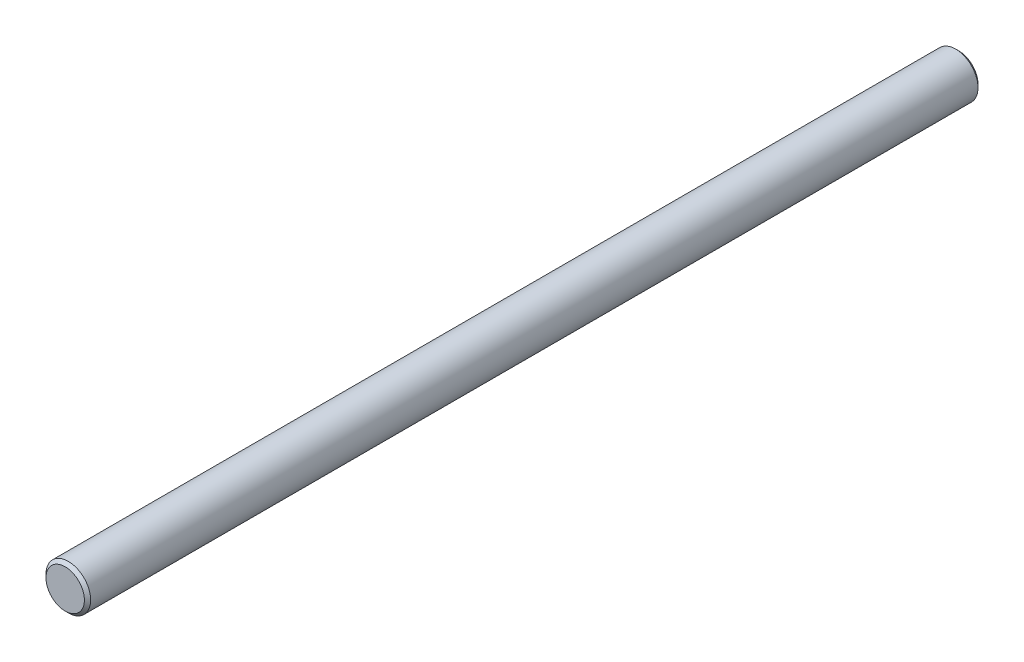
ISO-10303-21;
HEADER;
FILE_DESCRIPTION(('STEP AP214'),'2;1');
FILE_NAME('part.step','',(''),(''),'','','');
FILE_SCHEMA(('AUTOMOTIVE_DESIGN { 1 0 10303 214 1 1 1 1 }'));
ENDSEC;
DATA;
#1=APPLICATION_CONTEXT('core data for automotive mechanical design processes');
#2=APPLICATION_PROTOCOL_DEFINITION('international standard','automotive_design',2000,#1);
#3=PRODUCT_CONTEXT('',#1,'mechanical');
#4=PRODUCT('Part','Part','',(#3));
#5=PRODUCT_RELATED_PRODUCT_CATEGORY('part','',(#4));
#6=PRODUCT_DEFINITION_FORMATION('','',#4);
#7=PRODUCT_DEFINITION_CONTEXT('part definition',#1,'design');
#8=PRODUCT_DEFINITION('design','',#6,#7);
#9=PRODUCT_DEFINITION_SHAPE('','',#8);
#10=(LENGTH_UNIT() NAMED_UNIT(*) SI_UNIT(.MILLI.,.METRE.));
#11=(NAMED_UNIT(*) PLANE_ANGLE_UNIT() SI_UNIT($,.RADIAN.));
#12=(NAMED_UNIT(*) SI_UNIT($,.STERADIAN.) SOLID_ANGLE_UNIT());
#13=UNCERTAINTY_MEASURE_WITH_UNIT(LENGTH_MEASURE(1.E-05),#10,'distance_accuracy_value','');
#14=(GEOMETRIC_REPRESENTATION_CONTEXT(3) GLOBAL_UNCERTAINTY_ASSIGNED_CONTEXT((#13)) GLOBAL_UNIT_ASSIGNED_CONTEXT((#10,
#11,#12)) REPRESENTATION_CONTEXT('',''));
#15=CARTESIAN_POINT('',(0.,0.,0.));
#16=DIRECTION('',(0.,0.,1.));
#17=DIRECTION('',(1.,0.,0.));
#18=AXIS2_PLACEMENT_3D('',#15,#16,#17);
#19=CARTESIAN_POINT('',(0.,0.,50.));
#20=DIRECTION('',(0.,0.,-1.));
#21=DIRECTION('',(-1.,0.,0.));
#22=AXIS2_PLACEMENT_3D('',#19,#20,#21);
#23=CYLINDRICAL_SURFACE('',#22,2.5);
#24=CARTESIAN_POINT('',(0.,0.,-49.65));
#25=DIRECTION('',(0.,0.,1.));
#26=DIRECTION('',(1.,0.,0.));
#27=AXIS2_PLACEMENT_3D('',#24,#25,#26);
#28=CIRCLE('',#27,2.5);
#29=CARTESIAN_POINT('',(2.5,0.,-49.65));
#30=VERTEX_POINT('',#29);
#31=EDGE_CURVE('E43',#30,#30,#28,.T.);
#32=ORIENTED_EDGE('',*,*,#31,.T.);
#33=EDGE_LOOP('',(#32));
#34=FACE_BOUND('',#33,.T.);
#35=CARTESIAN_POINT('',(0.,0.,49.65));
#36=DIRECTION('',(0.,0.,1.));
#37=DIRECTION('',(1.,0.,0.));
#38=AXIS2_PLACEMENT_3D('',#35,#36,#37);
#39=CIRCLE('',#38,2.5);
#40=CARTESIAN_POINT('',(2.5,0.,49.65));
#41=VERTEX_POINT('',#40);
#42=EDGE_CURVE('E47',#41,#41,#39,.F.);
#43=ORIENTED_EDGE('',*,*,#42,.T.);
#44=EDGE_LOOP('',(#43));
#45=FACE_BOUND('',#44,.T.);
#46=ADVANCED_FACE('F32',(#34,#45),#23,.T.);
#47=CARTESIAN_POINT('',(0.,0.,50.));
#48=DIRECTION('',(0.,0.,1.));
#49=DIRECTION('',(1.,0.,0.));
#50=AXIS2_PLACEMENT_3D('',#47,#48,#49);
#51=PLANE('',#50);
#52=CARTESIAN_POINT('',(0.,0.,50.));
#53=DIRECTION('',(0.,0.,1.));
#54=DIRECTION('',(1.,0.,0.));
#55=AXIS2_PLACEMENT_3D('',#52,#53,#54);
#56=CIRCLE('',#55,2.15000000000003);
#57=CARTESIAN_POINT('',(2.15000000000003,0.,50.));
#58=VERTEX_POINT('',#57);
#59=EDGE_CURVE('E10',#58,#58,#56,.T.);
#60=ORIENTED_EDGE('',*,*,#59,.T.);
#61=EDGE_LOOP('',(#60));
#62=FACE_BOUND('',#61,.T.);
#63=ADVANCED_FACE('F63',(#62),#51,.T.);
#64=CARTESIAN_POINT('',(0.,0.,-50.));
#65=DIRECTION('',(0.,0.,1.));
#66=DIRECTION('',(1.,0.,0.));
#67=AXIS2_PLACEMENT_3D('',#64,#65,#66);
#68=PLANE('',#67);
#69=CARTESIAN_POINT('',(0.,0.,-50.));
#70=DIRECTION('',(0.,0.,1.));
#71=DIRECTION('',(1.,0.,0.));
#72=AXIS2_PLACEMENT_3D('',#69,#70,#71);
#73=CIRCLE('',#72,2.15);
#74=CARTESIAN_POINT('',(2.15,0.,-50.));
#75=VERTEX_POINT('',#74);
#76=EDGE_CURVE('E39',#75,#75,#73,.F.);
#77=ORIENTED_EDGE('',*,*,#76,.T.);
#78=EDGE_LOOP('',(#77));
#79=FACE_BOUND('',#78,.T.);
#80=ADVANCED_FACE('F60',(#79),#68,.F.);
#81=CARTESIAN_POINT('',(0.,0.,-49.65));
#82=DIRECTION('',(0.,0.,1.));
#83=DIRECTION('',(1.,0.,0.));
#84=AXIS2_PLACEMENT_3D('',#81,#82,#83);
#85=CONICAL_SURFACE('',#84,2.5,0.785398163397465);
#86=ORIENTED_EDGE('',*,*,#76,.F.);
#87=EDGE_LOOP('',(#86));
#88=FACE_BOUND('',#87,.T.);
#89=ORIENTED_EDGE('',*,*,#31,.F.);
#90=EDGE_LOOP('',(#89));
#91=FACE_BOUND('',#90,.T.);
#92=ADVANCED_FACE('F56',(#88,#91),#85,.T.);
#93=CARTESIAN_POINT('',(0.,0.,50.));
#94=DIRECTION('',(0.,0.,-1.));
#95=DIRECTION('',(-1.,0.,0.));
#96=AXIS2_PLACEMENT_3D('',#93,#94,#95);
#97=CONICAL_SURFACE('',#96,2.15000000000003,0.785398163397435);
#98=ORIENTED_EDGE('',*,*,#42,.F.);
#99=EDGE_LOOP('',(#98));
#100=FACE_BOUND('',#99,.T.);
#101=ORIENTED_EDGE('',*,*,#59,.F.);
#102=EDGE_LOOP('',(#101));
#103=FACE_BOUND('',#102,.T.);
#104=ADVANCED_FACE('F34',(#100,#103),#97,.T.);
#105=CLOSED_SHELL('',(#46,#63,#80,#92,#104));
#106=MANIFOLD_SOLID_BREP('B2',#105);
#107=ADVANCED_BREP_SHAPE_REPRESENTATION('',(#18,#106),#14);
#108=SHAPE_DEFINITION_REPRESENTATION(#9,#107);
ENDSEC;
END-ISO-10303-21;
